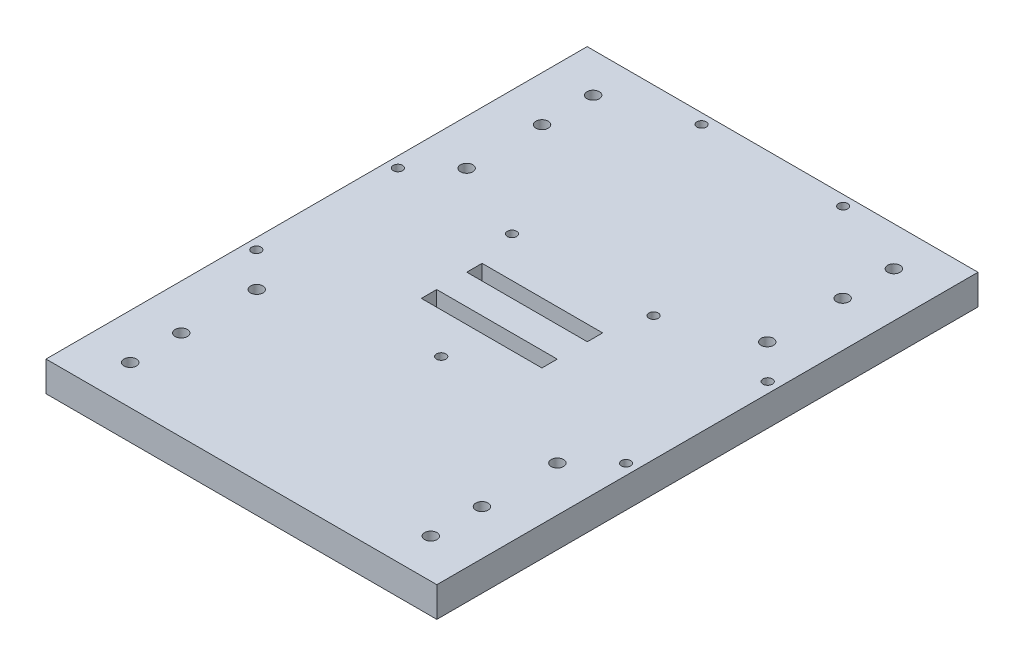
ISO-10303-21;
HEADER;
FILE_DESCRIPTION(('STEP AP214'),'2;1');
FILE_NAME('part.step','',(''),(''),'','','');
FILE_SCHEMA(('AUTOMOTIVE_DESIGN { 1 0 10303 214 1 1 1 1 }'));
ENDSEC;
DATA;
#1=APPLICATION_CONTEXT('core data for automotive mechanical design processes');
#2=APPLICATION_PROTOCOL_DEFINITION('international standard','automotive_design',2000,#1);
#3=PRODUCT_CONTEXT('',#1,'mechanical');
#4=PRODUCT('Part','Part','',(#3));
#5=PRODUCT_RELATED_PRODUCT_CATEGORY('part','',(#4));
#6=PRODUCT_DEFINITION_FORMATION('','',#4);
#7=PRODUCT_DEFINITION_CONTEXT('part definition',#1,'design');
#8=PRODUCT_DEFINITION('design','',#6,#7);
#9=PRODUCT_DEFINITION_SHAPE('','',#8);
#10=(LENGTH_UNIT() NAMED_UNIT(*) SI_UNIT(.MILLI.,.METRE.));
#11=(NAMED_UNIT(*) PLANE_ANGLE_UNIT() SI_UNIT($,.RADIAN.));
#12=(NAMED_UNIT(*) SI_UNIT($,.STERADIAN.) SOLID_ANGLE_UNIT());
#13=UNCERTAINTY_MEASURE_WITH_UNIT(LENGTH_MEASURE(1.E-05),#10,'distance_accuracy_value','');
#14=(GEOMETRIC_REPRESENTATION_CONTEXT(3) GLOBAL_UNCERTAINTY_ASSIGNED_CONTEXT((#13)) GLOBAL_UNIT_ASSIGNED_CONTEXT((#10,
#11,#12)) REPRESENTATION_CONTEXT('',''));
#15=CARTESIAN_POINT('',(0.,0.,0.));
#16=DIRECTION('',(0.,0.,1.));
#17=DIRECTION('',(1.,0.,0.));
#18=AXIS2_PLACEMENT_3D('',#15,#16,#17);
#19=CARTESIAN_POINT('',(0.,10.,0.));
#20=DIRECTION('',(0.,1.,0.));
#21=DIRECTION('',(0.,0.,1.));
#22=AXIS2_PLACEMENT_3D('',#19,#20,#21);
#23=PLANE('',#22);
#24=CARTESIAN_POINT('',(-23.5499999999998,10.,-23.5499999999994));
#25=DIRECTION('',(0.,1.,0.));
#26=DIRECTION('',(0.,0.,1.));
#27=AXIS2_PLACEMENT_3D('',#24,#25,#26);
#28=CIRCLE('',#27,1.55);
#29=CARTESIAN_POINT('',(-23.5499999999998,10.,-21.9999999999994));
#30=VERTEX_POINT('',#29);
#31=EDGE_CURVE('E821',#30,#30,#28,.T.);
#32=ORIENTED_EDGE('',*,*,#31,.F.);
#33=EDGE_LOOP('',(#32));
#34=FACE_BOUND('',#33,.T.);
#35=CARTESIAN_POINT('',(-61.5000000000001,10.,-23.5499999999991));
#36=DIRECTION('',(0.,1.,0.));
#37=DIRECTION('',(0.,0.,1.));
#38=AXIS2_PLACEMENT_3D('',#35,#36,#37);
#39=CIRCLE('',#38,1.54999999999999);
#40=CARTESIAN_POINT('',(-61.5000000000001,10.,-21.9999999999991));
#41=VERTEX_POINT('',#40);
#42=EDGE_CURVE('E825',#41,#41,#39,.T.);
#43=ORIENTED_EDGE('',*,*,#42,.F.);
#44=EDGE_LOOP('',(#43));
#45=FACE_BOUND('',#44,.T.);
#46=CARTESIAN_POINT('',(23.5500000000002,10.,-23.5499999999997));
#47=DIRECTION('',(0.,1.,0.));
#48=DIRECTION('',(0.,0.,1.));
#49=AXIS2_PLACEMENT_3D('',#46,#47,#48);
#50=CIRCLE('',#49,1.54999999999999);
#51=CARTESIAN_POINT('',(23.5500000000002,10.,-21.9999999999997));
#52=VERTEX_POINT('',#51);
#53=EDGE_CURVE('E832',#52,#52,#50,.T.);
#54=ORIENTED_EDGE('',*,*,#53,.F.);
#55=EDGE_LOOP('',(#54));
#56=FACE_BOUND('',#55,.T.);
#57=CARTESIAN_POINT('',(23.5499999999997,10.,-86.5999999999998));
#58=DIRECTION('',(0.,1.,0.));
#59=DIRECTION('',(0.,0.,1.));
#60=AXIS2_PLACEMENT_3D('',#57,#58,#59);
#61=CIRCLE('',#60,1.54999999999999);
#62=CARTESIAN_POINT('',(23.5499999999997,10.,-85.0499999999998));
#63=VERTEX_POINT('',#62);
#64=EDGE_CURVE('E838',#63,#63,#61,.T.);
#65=ORIENTED_EDGE('',*,*,#64,.F.);
#66=EDGE_LOOP('',(#65));
#67=FACE_BOUND('',#66,.T.);
#68=CARTESIAN_POINT('',(61.5000000000008,10.,23.55));
#69=DIRECTION('',(0.,1.,0.));
#70=DIRECTION('',(0.,0.,1.));
#71=AXIS2_PLACEMENT_3D('',#68,#69,#70);
#72=CIRCLE('',#71,1.55000000000001);
#73=CARTESIAN_POINT('',(61.5000000000008,10.,25.1));
#74=VERTEX_POINT('',#73);
#75=EDGE_CURVE('E853',#74,#74,#72,.T.);
#76=ORIENTED_EDGE('',*,*,#75,.F.);
#77=EDGE_LOOP('',(#76));
#78=FACE_BOUND('',#77,.T.);
#79=CARTESIAN_POINT('',(7.91033905045424E-13,10.,23.5500000000005));
#80=DIRECTION('',(0.,1.,0.));
#81=DIRECTION('',(0.,0.,1.));
#82=AXIS2_PLACEMENT_3D('',#79,#80,#81);
#83=CIRCLE('',#82,1.55);
#84=CARTESIAN_POINT('',(7.91033905045424E-13,10.,25.1000000000005));
#85=VERTEX_POINT('',#84);
#86=EDGE_CURVE('E857',#85,#85,#83,.T.);
#87=ORIENTED_EDGE('',*,*,#86,.F.);
#88=EDGE_LOOP('',(#87));
#89=FACE_BOUND('',#88,.T.);
#90=CARTESIAN_POINT('',(-61.4999999999998,10.,23.5500000000009));
#91=DIRECTION('',(0.,1.,0.));
#92=DIRECTION('',(0.,0.,1.));
#93=AXIS2_PLACEMENT_3D('',#90,#91,#92);
#94=CIRCLE('',#93,1.55);
#95=CARTESIAN_POINT('',(-61.4999999999998,10.,25.1000000000009));
#96=VERTEX_POINT('',#95);
#97=EDGE_CURVE('E861',#96,#96,#94,.T.);
#98=ORIENTED_EDGE('',*,*,#97,.F.);
#99=EDGE_LOOP('',(#98));
#100=FACE_BOUND('',#99,.T.);
#101=CARTESIAN_POINT('',(61.5000000000005,10.,-23.55));
#102=DIRECTION('',(0.,1.,0.));
#103=DIRECTION('',(0.,0.,1.));
#104=AXIS2_PLACEMENT_3D('',#101,#102,#103);
#105=CIRCLE('',#104,1.54999999999999);
#106=CARTESIAN_POINT('',(61.5000000000005,10.,-22.));
#107=VERTEX_POINT('',#106);
#108=EDGE_CURVE('E844',#107,#107,#105,.T.);
#109=ORIENTED_EDGE('',*,*,#108,.F.);
#110=EDGE_LOOP('',(#109));
#111=FACE_BOUND('',#110,.T.);
#112=CARTESIAN_POINT('',(-23.5500000000003,10.,-86.5999999999995));
#113=DIRECTION('',(0.,1.,0.));
#114=DIRECTION('',(0.,0.,1.));
#115=AXIS2_PLACEMENT_3D('',#112,#113,#114);
#116=CIRCLE('',#115,1.55);
#117=CARTESIAN_POINT('',(-23.5500000000003,10.,-85.0499999999995));
#118=VERTEX_POINT('',#117);
#119=EDGE_CURVE('E822',#118,#118,#116,.T.);
#120=ORIENTED_EDGE('',*,*,#119,.F.);
#121=EDGE_LOOP('',(#120));
#122=FACE_BOUND('',#121,.T.);
#123=DIRECTION('',(0.,0.,1.));
#124=VECTOR('',#123,1.);
#125=CARTESIAN_POINT('',(-20.05,10.,-10.1));
#126=LINE('',#125,#124);
#127=CARTESIAN_POINT('',(-20.05,10.,-10.1));
#128=VERTEX_POINT('',#127);
#129=CARTESIAN_POINT('',(-20.05,10.,-5.));
#130=VERTEX_POINT('',#129);
#131=EDGE_CURVE('E54',#128,#130,#126,.T.);
#132=ORIENTED_EDGE('',*,*,#131,.F.);
#133=DIRECTION('',(-1.,0.,0.));
#134=VECTOR('',#133,1.);
#135=CARTESIAN_POINT('',(20.05,10.,-10.1));
#136=LINE('',#135,#134);
#137=CARTESIAN_POINT('',(20.05,10.,-10.1));
#138=VERTEX_POINT('',#137);
#139=EDGE_CURVE('E149',#138,#128,#136,.T.);
#140=ORIENTED_EDGE('',*,*,#139,.F.);
#141=DIRECTION('',(0.,0.,-1.));
#142=VECTOR('',#141,1.);
#143=CARTESIAN_POINT('',(20.05,10.,-5.));
#144=LINE('',#143,#142);
#145=CARTESIAN_POINT('',(20.05,10.,-5.));
#146=VERTEX_POINT('',#145);
#147=EDGE_CURVE('E152',#146,#138,#144,.T.);
#148=ORIENTED_EDGE('',*,*,#147,.F.);
#149=DIRECTION('',(1.,0.,0.));
#150=VECTOR('',#149,1.);
#151=CARTESIAN_POINT('',(-20.05,10.,-5.));
#152=LINE('',#151,#150);
#153=EDGE_CURVE('E161',#130,#146,#152,.T.);
#154=ORIENTED_EDGE('',*,*,#153,.F.);
#155=EDGE_LOOP('',(#132,#140,#148,#154));
#156=FACE_BOUND('',#155,.T.);
#157=DIRECTION('',(0.,0.,-1.));
#158=VECTOR('',#157,1.);
#159=CARTESIAN_POINT('',(20.05,10.,10.1));
#160=LINE('',#159,#158);
#161=CARTESIAN_POINT('',(20.05,10.,10.1));
#162=VERTEX_POINT('',#161);
#163=CARTESIAN_POINT('',(20.05,10.,5.));
#164=VERTEX_POINT('',#163);
#165=EDGE_CURVE('E62',#162,#164,#160,.T.);
#166=ORIENTED_EDGE('',*,*,#165,.F.);
#167=DIRECTION('',(1.,0.,0.));
#168=VECTOR('',#167,1.);
#169=CARTESIAN_POINT('',(-20.05,10.,10.1));
#170=LINE('',#169,#168);
#171=CARTESIAN_POINT('',(-20.05,10.,10.1));
#172=VERTEX_POINT('',#171);
#173=EDGE_CURVE('E180',#172,#162,#170,.T.);
#174=ORIENTED_EDGE('',*,*,#173,.F.);
#175=DIRECTION('',(0.,0.,1.));
#176=VECTOR('',#175,1.);
#177=CARTESIAN_POINT('',(-20.05,10.,5.));
#178=LINE('',#177,#176);
#179=CARTESIAN_POINT('',(-20.05,10.,5.));
#180=VERTEX_POINT('',#179);
#181=EDGE_CURVE('E183',#180,#172,#178,.T.);
#182=ORIENTED_EDGE('',*,*,#181,.F.);
#183=DIRECTION('',(-1.,0.,0.));
#184=VECTOR('',#183,1.);
#185=CARTESIAN_POINT('',(-20.05,10.,5.));
#186=LINE('',#185,#184);
#187=EDGE_CURVE('E187',#164,#180,#186,.T.);
#188=ORIENTED_EDGE('',*,*,#187,.F.);
#189=EDGE_LOOP('',(#166,#174,#182,#188));
#190=FACE_BOUND('',#189,.T.);
#191=CARTESIAN_POINT('',(-50.,10.,-77.));
#192=DIRECTION('',(0.,1.,0.));
#193=DIRECTION('',(0.,0.,1.));
#194=AXIS2_PLACEMENT_3D('',#191,#192,#193);
#195=CIRCLE('',#194,2.04999999999999);
#196=CARTESIAN_POINT('',(-50.,10.,-74.95));
#197=VERTEX_POINT('',#196);
#198=EDGE_CURVE('E280',#197,#197,#195,.T.);
#199=ORIENTED_EDGE('',*,*,#198,.F.);
#200=EDGE_LOOP('',(#199));
#201=FACE_BOUND('',#200,.T.);
#202=DIRECTION('',(0.,0.,1.));
#203=VECTOR('',#202,1.);
#204=CARTESIAN_POINT('',(-65.,10.,-90.));
#205=LINE('',#204,#203);
#206=CARTESIAN_POINT('',(-65.,10.,-90.));
#207=VERTEX_POINT('',#206);
#208=CARTESIAN_POINT('',(-65.,10.,90.));
#209=VERTEX_POINT('',#208);
#210=EDGE_CURVE('E47',#207,#209,#205,.T.);
#211=ORIENTED_EDGE('',*,*,#210,.T.);
#212=DIRECTION('',(1.,0.,0.));
#213=VECTOR('',#212,1.);
#214=CARTESIAN_POINT('',(0.,10.,90.));
#215=LINE('',#214,#213);
#216=CARTESIAN_POINT('',(65.,10.,90.));
#217=VERTEX_POINT('',#216);
#218=EDGE_CURVE('E240',#209,#217,#215,.T.);
#219=ORIENTED_EDGE('',*,*,#218,.T.);
#220=DIRECTION('',(0.,0.,1.));
#221=VECTOR('',#220,1.);
#222=CARTESIAN_POINT('',(65.,10.,-90.));
#223=LINE('',#222,#221);
#224=CARTESIAN_POINT('',(65.,10.,-90.));
#225=VERTEX_POINT('',#224);
#226=EDGE_CURVE('E267',#225,#217,#223,.T.);
#227=ORIENTED_EDGE('',*,*,#226,.F.);
#228=DIRECTION('',(-1.,0.,0.));
#229=VECTOR('',#228,1.);
#230=CARTESIAN_POINT('',(0.,10.,-90.));
#231=LINE('',#230,#229);
#232=EDGE_CURVE('E292',#225,#207,#231,.T.);
#233=ORIENTED_EDGE('',*,*,#232,.T.);
#234=EDGE_LOOP('',(#211,#219,#227,#233));
#235=FACE_BOUND('',#234,.T.);
#236=CARTESIAN_POINT('',(-50.,10.,-60.));
#237=DIRECTION('',(0.,1.,0.));
#238=DIRECTION('',(0.,0.,1.));
#239=AXIS2_PLACEMENT_3D('',#236,#237,#238);
#240=CIRCLE('',#239,2.05);
#241=CARTESIAN_POINT('',(-50.,10.,-57.95));
#242=VERTEX_POINT('',#241);
#243=EDGE_CURVE('E286',#242,#242,#240,.T.);
#244=ORIENTED_EDGE('',*,*,#243,.F.);
#245=EDGE_LOOP('',(#244));
#246=FACE_BOUND('',#245,.T.);
#247=CARTESIAN_POINT('',(-50.,10.,-34.9));
#248=DIRECTION('',(0.,1.,0.));
#249=DIRECTION('',(0.,0.,1.));
#250=AXIS2_PLACEMENT_3D('',#247,#248,#249);
#251=CIRCLE('',#250,2.04999999999999);
#252=CARTESIAN_POINT('',(-50.,10.,-32.85));
#253=VERTEX_POINT('',#252);
#254=EDGE_CURVE('E274',#253,#253,#251,.T.);
#255=ORIENTED_EDGE('',*,*,#254,.F.);
#256=EDGE_LOOP('',(#255));
#257=FACE_BOUND('',#256,.T.);
#258=CARTESIAN_POINT('',(50.,10.,-34.9));
#259=DIRECTION('',(0.,-1.,0.));
#260=DIRECTION('',(0.,0.,1.));
#261=AXIS2_PLACEMENT_3D('',#258,#259,#260);
#262=CIRCLE('',#261,2.04999999999999);
#263=CARTESIAN_POINT('',(50.,10.,-32.85));
#264=VERTEX_POINT('',#263);
#265=EDGE_CURVE('E249',#264,#264,#262,.T.);
#266=ORIENTED_EDGE('',*,*,#265,.T.);
#267=EDGE_LOOP('',(#266));
#268=FACE_BOUND('',#267,.T.);
#269=CARTESIAN_POINT('',(50.,10.,-77.));
#270=DIRECTION('',(0.,-1.,0.));
#271=DIRECTION('',(0.,0.,1.));
#272=AXIS2_PLACEMENT_3D('',#269,#270,#271);
#273=CIRCLE('',#272,2.04999999999999);
#274=CARTESIAN_POINT('',(50.,10.,-74.95));
#275=VERTEX_POINT('',#274);
#276=EDGE_CURVE('E255',#275,#275,#273,.T.);
#277=ORIENTED_EDGE('',*,*,#276,.T.);
#278=EDGE_LOOP('',(#277));
#279=FACE_BOUND('',#278,.T.);
#280=CARTESIAN_POINT('',(50.,10.,-60.));
#281=DIRECTION('',(0.,-1.,0.));
#282=DIRECTION('',(0.,0.,1.));
#283=AXIS2_PLACEMENT_3D('',#280,#281,#282);
#284=CIRCLE('',#283,2.05);
#285=CARTESIAN_POINT('',(50.,10.,-57.95));
#286=VERTEX_POINT('',#285);
#287=EDGE_CURVE('E261',#286,#286,#284,.T.);
#288=ORIENTED_EDGE('',*,*,#287,.T.);
#289=EDGE_LOOP('',(#288));
#290=FACE_BOUND('',#289,.T.);
#291=CARTESIAN_POINT('',(50.,10.,77.));
#292=DIRECTION('',(0.,1.,0.));
#293=DIRECTION('',(0.,0.,-1.));
#294=AXIS2_PLACEMENT_3D('',#291,#292,#293);
#295=CIRCLE('',#294,2.04999999999999);
#296=CARTESIAN_POINT('',(50.,10.,74.95));
#297=VERTEX_POINT('',#296);
#298=EDGE_CURVE('E228',#297,#297,#295,.T.);
#299=ORIENTED_EDGE('',*,*,#298,.F.);
#300=EDGE_LOOP('',(#299));
#301=FACE_BOUND('',#300,.T.);
#302=CARTESIAN_POINT('',(50.,10.,60.));
#303=DIRECTION('',(0.,1.,0.));
#304=DIRECTION('',(0.,0.,-1.));
#305=AXIS2_PLACEMENT_3D('',#302,#303,#304);
#306=CIRCLE('',#305,2.05);
#307=CARTESIAN_POINT('',(50.,10.,57.95));
#308=VERTEX_POINT('',#307);
#309=EDGE_CURVE('E234',#308,#308,#306,.T.);
#310=ORIENTED_EDGE('',*,*,#309,.F.);
#311=EDGE_LOOP('',(#310));
#312=FACE_BOUND('',#311,.T.);
#313=CARTESIAN_POINT('',(50.,10.,34.9));
#314=DIRECTION('',(0.,1.,0.));
#315=DIRECTION('',(0.,0.,-1.));
#316=AXIS2_PLACEMENT_3D('',#313,#314,#315);
#317=CIRCLE('',#316,2.04999999999999);
#318=CARTESIAN_POINT('',(50.,10.,32.85));
#319=VERTEX_POINT('',#318);
#320=EDGE_CURVE('E222',#319,#319,#317,.T.);
#321=ORIENTED_EDGE('',*,*,#320,.F.);
#322=EDGE_LOOP('',(#321));
#323=FACE_BOUND('',#322,.T.);
#324=CARTESIAN_POINT('',(-50.,10.,34.9));
#325=DIRECTION('',(0.,-1.,0.));
#326=DIRECTION('',(0.,0.,-1.));
#327=AXIS2_PLACEMENT_3D('',#324,#325,#326);
#328=CIRCLE('',#327,2.04999999999999);
#329=CARTESIAN_POINT('',(-50.,10.,32.85));
#330=VERTEX_POINT('',#329);
#331=EDGE_CURVE('E201',#330,#330,#328,.T.);
#332=ORIENTED_EDGE('',*,*,#331,.T.);
#333=EDGE_LOOP('',(#332));
#334=FACE_BOUND('',#333,.T.);
#335=CARTESIAN_POINT('',(-50.,10.,77.));
#336=DIRECTION('',(0.,-1.,0.));
#337=DIRECTION('',(0.,0.,-1.));
#338=AXIS2_PLACEMENT_3D('',#335,#336,#337);
#339=CIRCLE('',#338,2.04999999999999);
#340=CARTESIAN_POINT('',(-50.,10.,74.95));
#341=VERTEX_POINT('',#340);
#342=EDGE_CURVE('E207',#341,#341,#339,.T.);
#343=ORIENTED_EDGE('',*,*,#342,.T.);
#344=EDGE_LOOP('',(#343));
#345=FACE_BOUND('',#344,.T.);
#346=CARTESIAN_POINT('',(-50.,10.,60.));
#347=DIRECTION('',(0.,-1.,0.));
#348=DIRECTION('',(0.,0.,-1.));
#349=AXIS2_PLACEMENT_3D('',#346,#347,#348);
#350=CIRCLE('',#349,2.05);
#351=CARTESIAN_POINT('',(-50.,10.,57.95));
#352=VERTEX_POINT('',#351);
#353=EDGE_CURVE('E213',#352,#352,#350,.T.);
#354=ORIENTED_EDGE('',*,*,#353,.T.);
#355=EDGE_LOOP('',(#354));
#356=FACE_BOUND('',#355,.T.);
#357=ADVANCED_FACE('F39',(#34,#45,#56,#67,#78,#89,#100,#111,#122,#156,#190,#201,#235,#246,#257,
#268,#279,#290,#301,#312,#323,#334,#345,#356),#23,.T.);
#358=CARTESIAN_POINT('',(0.,0.,0.));
#359=DIRECTION('',(0.,1.,0.));
#360=DIRECTION('',(0.,0.,1.));
#361=AXIS2_PLACEMENT_3D('',#358,#359,#360);
#362=PLANE('',#361);
#363=CARTESIAN_POINT('',(-23.5499999999998,0.,-23.5499999999994));
#364=DIRECTION('',(0.,1.,0.));
#365=DIRECTION('',(0.,0.,1.));
#366=AXIS2_PLACEMENT_3D('',#363,#364,#365);
#367=CIRCLE('',#366,1.55);
#368=CARTESIAN_POINT('',(-23.5499999999998,0.,-21.9999999999994));
#369=VERTEX_POINT('',#368);
#370=EDGE_CURVE('E819',#369,#369,#367,.F.);
#371=ORIENTED_EDGE('',*,*,#370,.F.);
#372=EDGE_LOOP('',(#371));
#373=FACE_BOUND('',#372,.T.);
#374=CARTESIAN_POINT('',(-61.5000000000001,0.,-23.5499999999991));
#375=DIRECTION('',(0.,1.,0.));
#376=DIRECTION('',(0.,0.,1.));
#377=AXIS2_PLACEMENT_3D('',#374,#375,#376);
#378=CIRCLE('',#377,1.54999999999999);
#379=CARTESIAN_POINT('',(-61.5000000000001,0.,-21.9999999999991));
#380=VERTEX_POINT('',#379);
#381=EDGE_CURVE('E829',#380,#380,#378,.F.);
#382=ORIENTED_EDGE('',*,*,#381,.F.);
#383=EDGE_LOOP('',(#382));
#384=FACE_BOUND('',#383,.T.);
#385=CARTESIAN_POINT('',(23.5500000000002,0.,-23.5499999999997));
#386=DIRECTION('',(0.,1.,0.));
#387=DIRECTION('',(0.,0.,1.));
#388=AXIS2_PLACEMENT_3D('',#385,#386,#387);
#389=CIRCLE('',#388,1.54999999999999);
#390=CARTESIAN_POINT('',(23.5500000000002,0.,-21.9999999999997));
#391=VERTEX_POINT('',#390);
#392=EDGE_CURVE('E835',#391,#391,#389,.F.);
#393=ORIENTED_EDGE('',*,*,#392,.F.);
#394=EDGE_LOOP('',(#393));
#395=FACE_BOUND('',#394,.T.);
#396=CARTESIAN_POINT('',(23.5499999999997,0.,-86.5999999999998));
#397=DIRECTION('',(0.,1.,0.));
#398=DIRECTION('',(0.,0.,1.));
#399=AXIS2_PLACEMENT_3D('',#396,#397,#398);
#400=CIRCLE('',#399,1.54999999999999);
#401=CARTESIAN_POINT('',(23.5499999999997,0.,-85.0499999999998));
#402=VERTEX_POINT('',#401);
#403=EDGE_CURVE('E841',#402,#402,#400,.F.);
#404=ORIENTED_EDGE('',*,*,#403,.F.);
#405=EDGE_LOOP('',(#404));
#406=FACE_BOUND('',#405,.T.);
#407=CARTESIAN_POINT('',(61.5000000000008,0.,23.55));
#408=DIRECTION('',(0.,1.,0.));
#409=DIRECTION('',(0.,0.,1.));
#410=AXIS2_PLACEMENT_3D('',#407,#408,#409);
#411=CIRCLE('',#410,1.55000000000001);
#412=CARTESIAN_POINT('',(61.5000000000008,0.,25.1));
#413=VERTEX_POINT('',#412);
#414=EDGE_CURVE('E884',#413,#413,#411,.F.);
#415=ORIENTED_EDGE('',*,*,#414,.F.);
#416=EDGE_LOOP('',(#415));
#417=FACE_BOUND('',#416,.T.);
#418=CARTESIAN_POINT('',(7.91033905045424E-13,0.,23.5500000000005));
#419=DIRECTION('',(0.,1.,0.));
#420=DIRECTION('',(0.,0.,1.));
#421=AXIS2_PLACEMENT_3D('',#418,#419,#420);
#422=CIRCLE('',#421,1.55);
#423=CARTESIAN_POINT('',(7.91033905045424E-13,0.,25.1000000000005));
#424=VERTEX_POINT('',#423);
#425=EDGE_CURVE('E878',#424,#424,#422,.F.);
#426=ORIENTED_EDGE('',*,*,#425,.F.);
#427=EDGE_LOOP('',(#426));
#428=FACE_BOUND('',#427,.T.);
#429=CARTESIAN_POINT('',(-61.4999999999998,0.,23.5500000000009));
#430=DIRECTION('',(0.,1.,0.));
#431=DIRECTION('',(0.,0.,1.));
#432=AXIS2_PLACEMENT_3D('',#429,#430,#431);
#433=CIRCLE('',#432,1.55);
#434=CARTESIAN_POINT('',(-61.4999999999998,0.,25.1000000000009));
#435=VERTEX_POINT('',#434);
#436=EDGE_CURVE('E874',#435,#435,#433,.F.);
#437=ORIENTED_EDGE('',*,*,#436,.F.);
#438=EDGE_LOOP('',(#437));
#439=FACE_BOUND('',#438,.T.);
#440=CARTESIAN_POINT('',(61.5000000000005,0.,-23.55));
#441=DIRECTION('',(0.,1.,0.));
#442=DIRECTION('',(0.,0.,1.));
#443=AXIS2_PLACEMENT_3D('',#440,#441,#442);
#444=CIRCLE('',#443,1.54999999999999);
#445=CARTESIAN_POINT('',(61.5000000000005,0.,-22.));
#446=VERTEX_POINT('',#445);
#447=EDGE_CURVE('E868',#446,#446,#444,.F.);
#448=ORIENTED_EDGE('',*,*,#447,.F.);
#449=EDGE_LOOP('',(#448));
#450=FACE_BOUND('',#449,.T.);
#451=CARTESIAN_POINT('',(-23.5500000000003,0.,-86.5999999999995));
#452=DIRECTION('',(0.,1.,0.));
#453=DIRECTION('',(0.,0.,1.));
#454=AXIS2_PLACEMENT_3D('',#451,#452,#453);
#455=CIRCLE('',#454,1.55);
#456=CARTESIAN_POINT('',(-23.5500000000003,0.,-85.0499999999995));
#457=VERTEX_POINT('',#456);
#458=EDGE_CURVE('E155',#457,#457,#455,.F.);
#459=ORIENTED_EDGE('',*,*,#458,.F.);
#460=EDGE_LOOP('',(#459));
#461=FACE_BOUND('',#460,.T.);
#462=DIRECTION('',(-1.,0.,0.));
#463=VECTOR('',#462,1.);
#464=CARTESIAN_POINT('',(20.05,0.,-10.1));
#465=LINE('',#464,#463);
#466=CARTESIAN_POINT('',(20.05,0.,-10.1));
#467=VERTEX_POINT('',#466);
#468=CARTESIAN_POINT('',(-20.05,0.,-10.1));
#469=VERTEX_POINT('',#468);
#470=EDGE_CURVE('E136',#467,#469,#465,.T.);
#471=ORIENTED_EDGE('',*,*,#470,.T.);
#472=DIRECTION('',(0.,0.,1.));
#473=VECTOR('',#472,1.);
#474=CARTESIAN_POINT('',(-20.05,0.,-10.1));
#475=LINE('',#474,#473);
#476=CARTESIAN_POINT('',(-20.05,0.,-5.));
#477=VERTEX_POINT('',#476);
#478=EDGE_CURVE('E130',#469,#477,#475,.T.);
#479=ORIENTED_EDGE('',*,*,#478,.T.);
#480=DIRECTION('',(1.,0.,0.));
#481=VECTOR('',#480,1.);
#482=CARTESIAN_POINT('',(-20.05,0.,-5.));
#483=LINE('',#482,#481);
#484=CARTESIAN_POINT('',(20.05,0.,-5.));
#485=VERTEX_POINT('',#484);
#486=EDGE_CURVE('E140',#477,#485,#483,.T.);
#487=ORIENTED_EDGE('',*,*,#486,.T.);
#488=DIRECTION('',(0.,0.,-1.));
#489=VECTOR('',#488,1.);
#490=CARTESIAN_POINT('',(20.05,0.,-5.));
#491=LINE('',#490,#489);
#492=EDGE_CURVE('E144',#485,#467,#491,.T.);
#493=ORIENTED_EDGE('',*,*,#492,.T.);
#494=EDGE_LOOP('',(#471,#479,#487,#493));
#495=FACE_BOUND('',#494,.T.);
#496=DIRECTION('',(1.,0.,0.));
#497=VECTOR('',#496,1.);
#498=CARTESIAN_POINT('',(-20.05,0.,10.1));
#499=LINE('',#498,#497);
#500=CARTESIAN_POINT('',(-20.05,0.,10.1));
#501=VERTEX_POINT('',#500);
#502=CARTESIAN_POINT('',(20.05,0.,10.1));
#503=VERTEX_POINT('',#502);
#504=EDGE_CURVE('E173',#501,#503,#499,.T.);
#505=ORIENTED_EDGE('',*,*,#504,.T.);
#506=DIRECTION('',(0.,0.,-1.));
#507=VECTOR('',#506,1.);
#508=CARTESIAN_POINT('',(20.05,0.,10.1));
#509=LINE('',#508,#507);
#510=CARTESIAN_POINT('',(20.05,0.,5.));
#511=VERTEX_POINT('',#510);
#512=EDGE_CURVE('E184',#503,#511,#509,.T.);
#513=ORIENTED_EDGE('',*,*,#512,.T.);
#514=DIRECTION('',(-1.,0.,0.));
#515=VECTOR('',#514,1.);
#516=CARTESIAN_POINT('',(-20.05,0.,5.));
#517=LINE('',#516,#515);
#518=CARTESIAN_POINT('',(-20.05,0.,5.));
#519=VERTEX_POINT('',#518);
#520=EDGE_CURVE('E196',#511,#519,#517,.T.);
#521=ORIENTED_EDGE('',*,*,#520,.T.);
#522=DIRECTION('',(0.,0.,1.));
#523=VECTOR('',#522,1.);
#524=CARTESIAN_POINT('',(-20.05,0.,5.));
#525=LINE('',#524,#523);
#526=EDGE_CURVE('E193',#519,#501,#525,.T.);
#527=ORIENTED_EDGE('',*,*,#526,.T.);
#528=EDGE_LOOP('',(#505,#513,#521,#527));
#529=FACE_BOUND('',#528,.T.);
#530=DIRECTION('',(1.,0.,0.));
#531=VECTOR('',#530,1.);
#532=CARTESIAN_POINT('',(0.,0.,90.));
#533=LINE('',#532,#531);
#534=CARTESIAN_POINT('',(-65.,0.,90.));
#535=VERTEX_POINT('',#534);
#536=CARTESIAN_POINT('',(65.,0.,90.));
#537=VERTEX_POINT('',#536);
#538=EDGE_CURVE('E237',#535,#537,#533,.T.);
#539=ORIENTED_EDGE('',*,*,#538,.F.);
#540=DIRECTION('',(0.,0.,1.));
#541=VECTOR('',#540,1.);
#542=CARTESIAN_POINT('',(-65.,0.,-90.));
#543=LINE('',#542,#541);
#544=CARTESIAN_POINT('',(-65.,0.,-90.));
#545=VERTEX_POINT('',#544);
#546=EDGE_CURVE('E294',#545,#535,#543,.T.);
#547=ORIENTED_EDGE('',*,*,#546,.F.);
#548=DIRECTION('',(-1.,0.,0.));
#549=VECTOR('',#548,1.);
#550=CARTESIAN_POINT('',(0.,0.,-90.));
#551=LINE('',#550,#549);
#552=CARTESIAN_POINT('',(65.,0.,-90.));
#553=VERTEX_POINT('',#552);
#554=EDGE_CURVE('E289',#553,#545,#551,.T.);
#555=ORIENTED_EDGE('',*,*,#554,.F.);
#556=DIRECTION('',(0.,0.,1.));
#557=VECTOR('',#556,1.);
#558=CARTESIAN_POINT('',(65.,0.,-90.));
#559=LINE('',#558,#557);
#560=EDGE_CURVE('E264',#553,#537,#559,.T.);
#561=ORIENTED_EDGE('',*,*,#560,.T.);
#562=EDGE_LOOP('',(#539,#547,#555,#561));
#563=FACE_BOUND('',#562,.T.);
#564=CARTESIAN_POINT('',(-50.,0.,-60.));
#565=DIRECTION('',(0.,1.,0.));
#566=DIRECTION('',(0.,0.,1.));
#567=AXIS2_PLACEMENT_3D('',#564,#565,#566);
#568=CIRCLE('',#567,2.05);
#569=CARTESIAN_POINT('',(-50.,0.,-57.95));
#570=VERTEX_POINT('',#569);
#571=EDGE_CURVE('E283',#570,#570,#568,.T.);
#572=ORIENTED_EDGE('',*,*,#571,.T.);
#573=EDGE_LOOP('',(#572));
#574=FACE_BOUND('',#573,.T.);
#575=CARTESIAN_POINT('',(-50.,0.,-77.));
#576=DIRECTION('',(0.,1.,0.));
#577=DIRECTION('',(0.,0.,1.));
#578=AXIS2_PLACEMENT_3D('',#575,#576,#577);
#579=CIRCLE('',#578,2.04999999999999);
#580=CARTESIAN_POINT('',(-50.,0.,-74.95));
#581=VERTEX_POINT('',#580);
#582=EDGE_CURVE('E277',#581,#581,#579,.T.);
#583=ORIENTED_EDGE('',*,*,#582,.T.);
#584=EDGE_LOOP('',(#583));
#585=FACE_BOUND('',#584,.T.);
#586=CARTESIAN_POINT('',(-50.,0.,-34.9));
#587=DIRECTION('',(0.,1.,0.));
#588=DIRECTION('',(0.,0.,1.));
#589=AXIS2_PLACEMENT_3D('',#586,#587,#588);
#590=CIRCLE('',#589,2.04999999999999);
#591=CARTESIAN_POINT('',(-50.,0.,-32.85));
#592=VERTEX_POINT('',#591);
#593=EDGE_CURVE('E273',#592,#592,#590,.T.);
#594=ORIENTED_EDGE('',*,*,#593,.T.);
#595=EDGE_LOOP('',(#594));
#596=FACE_BOUND('',#595,.T.);
#597=CARTESIAN_POINT('',(50.,0.,-34.9));
#598=DIRECTION('',(0.,-1.,0.));
#599=DIRECTION('',(0.,0.,1.));
#600=AXIS2_PLACEMENT_3D('',#597,#598,#599);
#601=CIRCLE('',#600,2.04999999999999);
#602=CARTESIAN_POINT('',(50.,0.,-32.85));
#603=VERTEX_POINT('',#602);
#604=EDGE_CURVE('E248',#603,#603,#601,.T.);
#605=ORIENTED_EDGE('',*,*,#604,.F.);
#606=EDGE_LOOP('',(#605));
#607=FACE_BOUND('',#606,.T.);
#608=CARTESIAN_POINT('',(50.,0.,-77.));
#609=DIRECTION('',(0.,-1.,0.));
#610=DIRECTION('',(0.,0.,1.));
#611=AXIS2_PLACEMENT_3D('',#608,#609,#610);
#612=CIRCLE('',#611,2.04999999999999);
#613=CARTESIAN_POINT('',(50.,0.,-74.95));
#614=VERTEX_POINT('',#613);
#615=EDGE_CURVE('E252',#614,#614,#612,.T.);
#616=ORIENTED_EDGE('',*,*,#615,.F.);
#617=EDGE_LOOP('',(#616));
#618=FACE_BOUND('',#617,.T.);
#619=CARTESIAN_POINT('',(50.,0.,-60.));
#620=DIRECTION('',(0.,-1.,0.));
#621=DIRECTION('',(0.,0.,1.));
#622=AXIS2_PLACEMENT_3D('',#619,#620,#621);
#623=CIRCLE('',#622,2.05);
#624=CARTESIAN_POINT('',(50.,0.,-57.95));
#625=VERTEX_POINT('',#624);
#626=EDGE_CURVE('E258',#625,#625,#623,.T.);
#627=ORIENTED_EDGE('',*,*,#626,.F.);
#628=EDGE_LOOP('',(#627));
#629=FACE_BOUND('',#628,.T.);
#630=CARTESIAN_POINT('',(50.,0.,60.));
#631=DIRECTION('',(0.,1.,0.));
#632=DIRECTION('',(0.,0.,-1.));
#633=AXIS2_PLACEMENT_3D('',#630,#631,#632);
#634=CIRCLE('',#633,2.05);
#635=CARTESIAN_POINT('',(50.,0.,57.95));
#636=VERTEX_POINT('',#635);
#637=EDGE_CURVE('E231',#636,#636,#634,.T.);
#638=ORIENTED_EDGE('',*,*,#637,.T.);
#639=EDGE_LOOP('',(#638));
#640=FACE_BOUND('',#639,.T.);
#641=CARTESIAN_POINT('',(50.,0.,77.));
#642=DIRECTION('',(0.,1.,0.));
#643=DIRECTION('',(0.,0.,-1.));
#644=AXIS2_PLACEMENT_3D('',#641,#642,#643);
#645=CIRCLE('',#644,2.04999999999999);
#646=CARTESIAN_POINT('',(50.,0.,74.95));
#647=VERTEX_POINT('',#646);
#648=EDGE_CURVE('E225',#647,#647,#645,.T.);
#649=ORIENTED_EDGE('',*,*,#648,.T.);
#650=EDGE_LOOP('',(#649));
#651=FACE_BOUND('',#650,.T.);
#652=CARTESIAN_POINT('',(50.,0.,34.9));
#653=DIRECTION('',(0.,1.,0.));
#654=DIRECTION('',(0.,0.,-1.));
#655=AXIS2_PLACEMENT_3D('',#652,#653,#654);
#656=CIRCLE('',#655,2.04999999999999);
#657=CARTESIAN_POINT('',(50.,0.,32.85));
#658=VERTEX_POINT('',#657);
#659=EDGE_CURVE('E221',#658,#658,#656,.T.);
#660=ORIENTED_EDGE('',*,*,#659,.T.);
#661=EDGE_LOOP('',(#660));
#662=FACE_BOUND('',#661,.T.);
#663=CARTESIAN_POINT('',(-50.,0.,34.9));
#664=DIRECTION('',(0.,-1.,0.));
#665=DIRECTION('',(0.,0.,-1.));
#666=AXIS2_PLACEMENT_3D('',#663,#664,#665);
#667=CIRCLE('',#666,2.04999999999999);
#668=CARTESIAN_POINT('',(-50.,0.,32.85));
#669=VERTEX_POINT('',#668);
#670=EDGE_CURVE('E167',#669,#669,#667,.T.);
#671=ORIENTED_EDGE('',*,*,#670,.F.);
#672=EDGE_LOOP('',(#671));
#673=FACE_BOUND('',#672,.T.);
#674=CARTESIAN_POINT('',(-50.,0.,77.));
#675=DIRECTION('',(0.,-1.,0.));
#676=DIRECTION('',(0.,0.,-1.));
#677=AXIS2_PLACEMENT_3D('',#674,#675,#676);
#678=CIRCLE('',#677,2.04999999999999);
#679=CARTESIAN_POINT('',(-50.,0.,74.95));
#680=VERTEX_POINT('',#679);
#681=EDGE_CURVE('E204',#680,#680,#678,.T.);
#682=ORIENTED_EDGE('',*,*,#681,.F.);
#683=EDGE_LOOP('',(#682));
#684=FACE_BOUND('',#683,.T.);
#685=CARTESIAN_POINT('',(-50.,0.,60.));
#686=DIRECTION('',(0.,-1.,0.));
#687=DIRECTION('',(0.,0.,-1.));
#688=AXIS2_PLACEMENT_3D('',#685,#686,#687);
#689=CIRCLE('',#688,2.05);
#690=CARTESIAN_POINT('',(-50.,0.,57.95));
#691=VERTEX_POINT('',#690);
#692=EDGE_CURVE('E210',#691,#691,#689,.T.);
#693=ORIENTED_EDGE('',*,*,#692,.F.);
#694=EDGE_LOOP('',(#693));
#695=FACE_BOUND('',#694,.T.);
#696=ADVANCED_FACE('F146',(#373,#384,#395,#406,#417,#428,#439,#450,#461,#495,#529,#563,#574,
#585,#596,#607,#618,#629,#640,#651,#662,#673,#684,#695),#362,.F.);
#697=CARTESIAN_POINT('',(0.,10.,-90.));
#698=DIRECTION('',(0.,0.,1.));
#699=DIRECTION('',(1.,0.,0.));
#700=AXIS2_PLACEMENT_3D('',#697,#698,#699);
#701=PLANE('',#700);
#702=ORIENTED_EDGE('',*,*,#554,.T.);
#703=DIRECTION('',(0.,-1.,0.));
#704=VECTOR('',#703,1.);
#705=CARTESIAN_POINT('',(-65.,10.,-90.));
#706=LINE('',#705,#704);
#707=EDGE_CURVE('E11',#207,#545,#706,.T.);
#708=ORIENTED_EDGE('',*,*,#707,.F.);
#709=ORIENTED_EDGE('',*,*,#232,.F.);
#710=DIRECTION('',(0.,-1.,0.));
#711=VECTOR('',#710,1.);
#712=CARTESIAN_POINT('',(65.,10.,-90.));
#713=LINE('',#712,#711);
#714=EDGE_CURVE('E269',#225,#553,#713,.T.);
#715=ORIENTED_EDGE('',*,*,#714,.T.);
#716=EDGE_LOOP('',(#702,#708,#709,#715));
#717=FACE_BOUND('',#716,.T.);
#718=ADVANCED_FACE('F41',(#717),#701,.F.);
#719=CARTESIAN_POINT('',(-65.,10.,-90.));
#720=DIRECTION('',(1.,0.,0.));
#721=DIRECTION('',(0.,0.,-1.));
#722=AXIS2_PLACEMENT_3D('',#719,#720,#721);
#723=PLANE('',#722);
#724=ORIENTED_EDGE('',*,*,#546,.T.);
#725=DIRECTION('',(0.,-1.,0.));
#726=VECTOR('',#725,1.);
#727=CARTESIAN_POINT('',(-65.,10.,90.));
#728=LINE('',#727,#726);
#729=EDGE_CURVE('E216',#209,#535,#728,.T.);
#730=ORIENTED_EDGE('',*,*,#729,.F.);
#731=ORIENTED_EDGE('',*,*,#210,.F.);
#732=ORIENTED_EDGE('',*,*,#707,.T.);
#733=EDGE_LOOP('',(#724,#730,#731,#732));
#734=FACE_BOUND('',#733,.T.);
#735=ADVANCED_FACE('F300',(#734),#723,.F.);
#736=CARTESIAN_POINT('',(-50.,10.,-60.));
#737=DIRECTION('',(0.,-1.,0.));
#738=DIRECTION('',(0.,0.,-1.));
#739=AXIS2_PLACEMENT_3D('',#736,#737,#738);
#740=CYLINDRICAL_SURFACE('',#739,2.05);
#741=ORIENTED_EDGE('',*,*,#243,.T.);
#742=EDGE_LOOP('',(#741));
#743=FACE_BOUND('',#742,.T.);
#744=ORIENTED_EDGE('',*,*,#571,.F.);
#745=EDGE_LOOP('',(#744));
#746=FACE_BOUND('',#745,.T.);
#747=ADVANCED_FACE('F342',(#743,#746),#740,.F.);
#748=CARTESIAN_POINT('',(-50.,10.,-77.));
#749=DIRECTION('',(0.,-1.,0.));
#750=DIRECTION('',(0.,0.,-1.));
#751=AXIS2_PLACEMENT_3D('',#748,#749,#750);
#752=CYLINDRICAL_SURFACE('',#751,2.04999999999999);
#753=ORIENTED_EDGE('',*,*,#198,.T.);
#754=EDGE_LOOP('',(#753));
#755=FACE_BOUND('',#754,.T.);
#756=ORIENTED_EDGE('',*,*,#582,.F.);
#757=EDGE_LOOP('',(#756));
#758=FACE_BOUND('',#757,.T.);
#759=ADVANCED_FACE('F328',(#755,#758),#752,.F.);
#760=CARTESIAN_POINT('',(-50.,10.,-34.9));
#761=DIRECTION('',(0.,-1.,0.));
#762=DIRECTION('',(0.,0.,-1.));
#763=AXIS2_PLACEMENT_3D('',#760,#761,#762);
#764=CYLINDRICAL_SURFACE('',#763,2.04999999999999);
#765=ORIENTED_EDGE('',*,*,#254,.T.);
#766=EDGE_LOOP('',(#765));
#767=FACE_BOUND('',#766,.T.);
#768=ORIENTED_EDGE('',*,*,#593,.F.);
#769=EDGE_LOOP('',(#768));
#770=FACE_BOUND('',#769,.T.);
#771=ADVANCED_FACE('F319',(#767,#770),#764,.F.);
#772=CARTESIAN_POINT('',(65.,10.,-90.));
#773=DIRECTION('',(1.,0.,0.));
#774=DIRECTION('',(0.,0.,-1.));
#775=AXIS2_PLACEMENT_3D('',#772,#773,#774);
#776=PLANE('',#775);
#777=ORIENTED_EDGE('',*,*,#560,.F.);
#778=ORIENTED_EDGE('',*,*,#714,.F.);
#779=ORIENTED_EDGE('',*,*,#226,.T.);
#780=DIRECTION('',(0.,-1.,0.));
#781=VECTOR('',#780,1.);
#782=CARTESIAN_POINT('',(65.,10.,90.));
#783=LINE('',#782,#781);
#784=EDGE_CURVE('E243',#217,#537,#783,.T.);
#785=ORIENTED_EDGE('',*,*,#784,.T.);
#786=EDGE_LOOP('',(#777,#778,#779,#785));
#787=FACE_BOUND('',#786,.T.);
#788=ADVANCED_FACE('F316',(#787),#776,.T.);
#789=CARTESIAN_POINT('',(50.,10.,-60.));
#790=DIRECTION('',(0.,-1.,0.));
#791=DIRECTION('',(0.,0.,-1.));
#792=AXIS2_PLACEMENT_3D('',#789,#790,#791);
#793=CYLINDRICAL_SURFACE('',#792,2.05);
#794=ORIENTED_EDGE('',*,*,#287,.F.);
#795=EDGE_LOOP('',(#794));
#796=FACE_BOUND('',#795,.T.);
#797=ORIENTED_EDGE('',*,*,#626,.T.);
#798=EDGE_LOOP('',(#797));
#799=FACE_BOUND('',#798,.T.);
#800=ADVANCED_FACE('F318',(#796,#799),#793,.F.);
#801=CARTESIAN_POINT('',(50.,10.,-77.));
#802=DIRECTION('',(0.,-1.,0.));
#803=DIRECTION('',(0.,0.,-1.));
#804=AXIS2_PLACEMENT_3D('',#801,#802,#803);
#805=CYLINDRICAL_SURFACE('',#804,2.04999999999999);
#806=ORIENTED_EDGE('',*,*,#276,.F.);
#807=EDGE_LOOP('',(#806));
#808=FACE_BOUND('',#807,.T.);
#809=ORIENTED_EDGE('',*,*,#615,.T.);
#810=EDGE_LOOP('',(#809));
#811=FACE_BOUND('',#810,.T.);
#812=ADVANCED_FACE('F325',(#808,#811),#805,.F.);
#813=CARTESIAN_POINT('',(50.,10.,-34.9));
#814=DIRECTION('',(0.,-1.,0.));
#815=DIRECTION('',(0.,0.,-1.));
#816=AXIS2_PLACEMENT_3D('',#813,#814,#815);
#817=CYLINDRICAL_SURFACE('',#816,2.04999999999999);
#818=ORIENTED_EDGE('',*,*,#265,.F.);
#819=EDGE_LOOP('',(#818));
#820=FACE_BOUND('',#819,.T.);
#821=ORIENTED_EDGE('',*,*,#604,.T.);
#822=EDGE_LOOP('',(#821));
#823=FACE_BOUND('',#822,.T.);
#824=ADVANCED_FACE('F615',(#820,#823),#817,.F.);
#825=CARTESIAN_POINT('',(0.,10.,90.));
#826=DIRECTION('',(0.,0.,-1.));
#827=DIRECTION('',(-1.,0.,0.));
#828=AXIS2_PLACEMENT_3D('',#825,#826,#827);
#829=PLANE('',#828);
#830=ORIENTED_EDGE('',*,*,#538,.T.);
#831=ORIENTED_EDGE('',*,*,#784,.F.);
#832=ORIENTED_EDGE('',*,*,#218,.F.);
#833=ORIENTED_EDGE('',*,*,#729,.T.);
#834=EDGE_LOOP('',(#830,#831,#832,#833));
#835=FACE_BOUND('',#834,.T.);
#836=ADVANCED_FACE('F309',(#835),#829,.F.);
#837=CARTESIAN_POINT('',(50.,10.,60.));
#838=DIRECTION('',(0.,-1.,0.));
#839=DIRECTION('',(0.,0.,-1.));
#840=AXIS2_PLACEMENT_3D('',#837,#838,#839);
#841=CYLINDRICAL_SURFACE('',#840,2.05);
#842=ORIENTED_EDGE('',*,*,#309,.T.);
#843=EDGE_LOOP('',(#842));
#844=FACE_BOUND('',#843,.T.);
#845=ORIENTED_EDGE('',*,*,#637,.F.);
#846=EDGE_LOOP('',(#845));
#847=FACE_BOUND('',#846,.T.);
#848=ADVANCED_FACE('F595',(#844,#847),#841,.F.);
#849=CARTESIAN_POINT('',(50.,10.,77.));
#850=DIRECTION('',(0.,-1.,0.));
#851=DIRECTION('',(0.,0.,-1.));
#852=AXIS2_PLACEMENT_3D('',#849,#850,#851);
#853=CYLINDRICAL_SURFACE('',#852,2.04999999999999);
#854=ORIENTED_EDGE('',*,*,#298,.T.);
#855=EDGE_LOOP('',(#854));
#856=FACE_BOUND('',#855,.T.);
#857=ORIENTED_EDGE('',*,*,#648,.F.);
#858=EDGE_LOOP('',(#857));
#859=FACE_BOUND('',#858,.T.);
#860=ADVANCED_FACE('F585',(#856,#859),#853,.F.);
#861=CARTESIAN_POINT('',(50.,10.,34.9));
#862=DIRECTION('',(0.,-1.,0.));
#863=DIRECTION('',(0.,0.,-1.));
#864=AXIS2_PLACEMENT_3D('',#861,#862,#863);
#865=CYLINDRICAL_SURFACE('',#864,2.04999999999999);
#866=ORIENTED_EDGE('',*,*,#320,.T.);
#867=EDGE_LOOP('',(#866));
#868=FACE_BOUND('',#867,.T.);
#869=ORIENTED_EDGE('',*,*,#659,.F.);
#870=EDGE_LOOP('',(#869));
#871=FACE_BOUND('',#870,.T.);
#872=ADVANCED_FACE('F575',(#868,#871),#865,.F.);
#873=CARTESIAN_POINT('',(-50.,10.,60.));
#874=DIRECTION('',(0.,-1.,0.));
#875=DIRECTION('',(0.,0.,-1.));
#876=AXIS2_PLACEMENT_3D('',#873,#874,#875);
#877=CYLINDRICAL_SURFACE('',#876,2.05);
#878=ORIENTED_EDGE('',*,*,#353,.F.);
#879=EDGE_LOOP('',(#878));
#880=FACE_BOUND('',#879,.T.);
#881=ORIENTED_EDGE('',*,*,#692,.T.);
#882=EDGE_LOOP('',(#881));
#883=FACE_BOUND('',#882,.T.);
#884=ADVANCED_FACE('F565',(#880,#883),#877,.F.);
#885=CARTESIAN_POINT('',(-50.,10.,77.));
#886=DIRECTION('',(0.,-1.,0.));
#887=DIRECTION('',(0.,0.,-1.));
#888=AXIS2_PLACEMENT_3D('',#885,#886,#887);
#889=CYLINDRICAL_SURFACE('',#888,2.04999999999999);
#890=ORIENTED_EDGE('',*,*,#342,.F.);
#891=EDGE_LOOP('',(#890));
#892=FACE_BOUND('',#891,.T.);
#893=ORIENTED_EDGE('',*,*,#681,.T.);
#894=EDGE_LOOP('',(#893));
#895=FACE_BOUND('',#894,.T.);
#896=ADVANCED_FACE('F555',(#892,#895),#889,.F.);
#897=CARTESIAN_POINT('',(-50.,10.,34.9));
#898=DIRECTION('',(0.,-1.,0.));
#899=DIRECTION('',(0.,0.,-1.));
#900=AXIS2_PLACEMENT_3D('',#897,#898,#899);
#901=CYLINDRICAL_SURFACE('',#900,2.04999999999999);
#902=ORIENTED_EDGE('',*,*,#331,.F.);
#903=EDGE_LOOP('',(#902));
#904=FACE_BOUND('',#903,.T.);
#905=ORIENTED_EDGE('',*,*,#670,.T.);
#906=EDGE_LOOP('',(#905));
#907=FACE_BOUND('',#906,.T.);
#908=ADVANCED_FACE('F546',(#904,#907),#901,.F.);
#909=CARTESIAN_POINT('',(20.05,0.,10.1));
#910=DIRECTION('',(1.,0.,0.));
#911=DIRECTION('',(0.,0.,-1.));
#912=AXIS2_PLACEMENT_3D('',#909,#910,#911);
#913=PLANE('',#912);
#914=ORIENTED_EDGE('',*,*,#165,.T.);
#915=DIRECTION('',(0.,1.,0.));
#916=VECTOR('',#915,1.);
#917=CARTESIAN_POINT('',(20.05,0.,5.));
#918=LINE('',#917,#916);
#919=EDGE_CURVE('E171',#511,#164,#918,.T.);
#920=ORIENTED_EDGE('',*,*,#919,.F.);
#921=ORIENTED_EDGE('',*,*,#512,.F.);
#922=DIRECTION('',(0.,1.,0.));
#923=VECTOR('',#922,1.);
#924=CARTESIAN_POINT('',(20.05,0.,10.1));
#925=LINE('',#924,#923);
#926=EDGE_CURVE('E178',#503,#162,#925,.T.);
#927=ORIENTED_EDGE('',*,*,#926,.T.);
#928=EDGE_LOOP('',(#914,#920,#921,#927));
#929=FACE_BOUND('',#928,.T.);
#930=ADVANCED_FACE('F536',(#929),#913,.F.);
#931=CARTESIAN_POINT('',(-20.05,0.,10.1));
#932=DIRECTION('',(0.,0.,1.));
#933=DIRECTION('',(1.,0.,0.));
#934=AXIS2_PLACEMENT_3D('',#931,#932,#933);
#935=PLANE('',#934);
#936=ORIENTED_EDGE('',*,*,#173,.T.);
#937=ORIENTED_EDGE('',*,*,#926,.F.);
#938=ORIENTED_EDGE('',*,*,#504,.F.);
#939=DIRECTION('',(0.,1.,0.));
#940=VECTOR('',#939,1.);
#941=CARTESIAN_POINT('',(-20.05,0.,10.1));
#942=LINE('',#941,#940);
#943=EDGE_CURVE('E176',#501,#172,#942,.T.);
#944=ORIENTED_EDGE('',*,*,#943,.T.);
#945=EDGE_LOOP('',(#936,#937,#938,#944));
#946=FACE_BOUND('',#945,.T.);
#947=ADVANCED_FACE('F526',(#946),#935,.F.);
#948=CARTESIAN_POINT('',(-20.05,0.,5.));
#949=DIRECTION('',(-1.,0.,0.));
#950=DIRECTION('',(0.,0.,1.));
#951=AXIS2_PLACEMENT_3D('',#948,#949,#950);
#952=PLANE('',#951);
#953=ORIENTED_EDGE('',*,*,#181,.T.);
#954=ORIENTED_EDGE('',*,*,#943,.F.);
#955=ORIENTED_EDGE('',*,*,#526,.F.);
#956=DIRECTION('',(0.,1.,0.));
#957=VECTOR('',#956,1.);
#958=CARTESIAN_POINT('',(-20.05,0.,5.));
#959=LINE('',#958,#957);
#960=EDGE_CURVE('E174',#519,#180,#959,.T.);
#961=ORIENTED_EDGE('',*,*,#960,.T.);
#962=EDGE_LOOP('',(#953,#954,#955,#961));
#963=FACE_BOUND('',#962,.T.);
#964=ADVANCED_FACE('F516',(#963),#952,.F.);
#965=CARTESIAN_POINT('',(-20.05,0.,5.));
#966=DIRECTION('',(0.,0.,-1.));
#967=DIRECTION('',(-1.,0.,0.));
#968=AXIS2_PLACEMENT_3D('',#965,#966,#967);
#969=PLANE('',#968);
#970=ORIENTED_EDGE('',*,*,#187,.T.);
#971=ORIENTED_EDGE('',*,*,#960,.F.);
#972=ORIENTED_EDGE('',*,*,#520,.F.);
#973=ORIENTED_EDGE('',*,*,#919,.T.);
#974=EDGE_LOOP('',(#970,#971,#972,#973));
#975=FACE_BOUND('',#974,.T.);
#976=ADVANCED_FACE('F507',(#975),#969,.F.);
#977=CARTESIAN_POINT('',(-20.05,0.,-10.1));
#978=DIRECTION('',(-1.,0.,0.));
#979=DIRECTION('',(0.,0.,1.));
#980=AXIS2_PLACEMENT_3D('',#977,#978,#979);
#981=PLANE('',#980);
#982=ORIENTED_EDGE('',*,*,#131,.T.);
#983=DIRECTION('',(0.,1.,0.));
#984=VECTOR('',#983,1.);
#985=CARTESIAN_POINT('',(-20.05,0.,-5.));
#986=LINE('',#985,#984);
#987=EDGE_CURVE('E126',#477,#130,#986,.T.);
#988=ORIENTED_EDGE('',*,*,#987,.F.);
#989=ORIENTED_EDGE('',*,*,#478,.F.);
#990=DIRECTION('',(0.,1.,0.));
#991=VECTOR('',#990,1.);
#992=CARTESIAN_POINT('',(-20.05,0.,-10.1));
#993=LINE('',#992,#991);
#994=EDGE_CURVE('E165',#469,#128,#993,.T.);
#995=ORIENTED_EDGE('',*,*,#994,.T.);
#996=EDGE_LOOP('',(#982,#988,#989,#995));
#997=FACE_BOUND('',#996,.T.);
#998=ADVANCED_FACE('F128',(#997),#981,.F.);
#999=CARTESIAN_POINT('',(20.05,0.,-10.1));
#1000=DIRECTION('',(0.,0.,-1.));
#1001=DIRECTION('',(-1.,0.,0.));
#1002=AXIS2_PLACEMENT_3D('',#999,#1000,#1001);
#1003=PLANE('',#1002);
#1004=ORIENTED_EDGE('',*,*,#139,.T.);
#1005=ORIENTED_EDGE('',*,*,#994,.F.);
#1006=ORIENTED_EDGE('',*,*,#470,.F.);
#1007=DIRECTION('',(0.,1.,0.));
#1008=VECTOR('',#1007,1.);
#1009=CARTESIAN_POINT('',(20.05,0.,-10.1));
#1010=LINE('',#1009,#1008);
#1011=EDGE_CURVE('E168',#467,#138,#1010,.T.);
#1012=ORIENTED_EDGE('',*,*,#1011,.T.);
#1013=EDGE_LOOP('',(#1004,#1005,#1006,#1012));
#1014=FACE_BOUND('',#1013,.T.);
#1015=ADVANCED_FACE('F488',(#1014),#1003,.F.);
#1016=CARTESIAN_POINT('',(20.05,0.,-5.));
#1017=DIRECTION('',(1.,0.,0.));
#1018=DIRECTION('',(0.,0.,-1.));
#1019=AXIS2_PLACEMENT_3D('',#1016,#1017,#1018);
#1020=PLANE('',#1019);
#1021=ORIENTED_EDGE('',*,*,#147,.T.);
#1022=ORIENTED_EDGE('',*,*,#1011,.F.);
#1023=ORIENTED_EDGE('',*,*,#492,.F.);
#1024=DIRECTION('',(0.,1.,0.));
#1025=VECTOR('',#1024,1.);
#1026=CARTESIAN_POINT('',(20.05,0.,-5.));
#1027=LINE('',#1026,#1025);
#1028=EDGE_CURVE('E135',#485,#146,#1027,.T.);
#1029=ORIENTED_EDGE('',*,*,#1028,.T.);
#1030=EDGE_LOOP('',(#1021,#1022,#1023,#1029));
#1031=FACE_BOUND('',#1030,.T.);
#1032=ADVANCED_FACE('F480',(#1031),#1020,.F.);
#1033=CARTESIAN_POINT('',(-20.05,0.,-5.));
#1034=DIRECTION('',(0.,0.,1.));
#1035=DIRECTION('',(1.,0.,0.));
#1036=AXIS2_PLACEMENT_3D('',#1033,#1034,#1035);
#1037=PLANE('',#1036);
#1038=ORIENTED_EDGE('',*,*,#153,.T.);
#1039=ORIENTED_EDGE('',*,*,#1028,.F.);
#1040=ORIENTED_EDGE('',*,*,#486,.F.);
#1041=ORIENTED_EDGE('',*,*,#987,.T.);
#1042=EDGE_LOOP('',(#1038,#1039,#1040,#1041));
#1043=FACE_BOUND('',#1042,.T.);
#1044=ADVANCED_FACE('F141',(#1043),#1037,.F.);
#1045=CARTESIAN_POINT('',(-23.5500000000003,-4.38406204335662,-86.5999999999995));
#1046=DIRECTION('',(0.,1.,0.));
#1047=DIRECTION('',(0.,0.,1.));
#1048=AXIS2_PLACEMENT_3D('',#1045,#1046,#1047);
#1049=CYLINDRICAL_SURFACE('',#1048,1.55);
#1050=ORIENTED_EDGE('',*,*,#458,.T.);
#1051=EDGE_LOOP('',(#1050));
#1052=FACE_BOUND('',#1051,.T.);
#1053=ORIENTED_EDGE('',*,*,#119,.T.);
#1054=EDGE_LOOP('',(#1053));
#1055=FACE_BOUND('',#1054,.T.);
#1056=ADVANCED_FACE('F368',(#1052,#1055),#1049,.F.);
#1057=CARTESIAN_POINT('',(61.5000000000005,-4.38406204335662,-23.55));
#1058=DIRECTION('',(0.,1.,0.));
#1059=DIRECTION('',(0.,0.,1.));
#1060=AXIS2_PLACEMENT_3D('',#1057,#1058,#1059);
#1061=CYLINDRICAL_SURFACE('',#1060,1.54999999999999);
#1062=ORIENTED_EDGE('',*,*,#447,.T.);
#1063=EDGE_LOOP('',(#1062));
#1064=FACE_BOUND('',#1063,.T.);
#1065=ORIENTED_EDGE('',*,*,#108,.T.);
#1066=EDGE_LOOP('',(#1065));
#1067=FACE_BOUND('',#1066,.T.);
#1068=ADVANCED_FACE('F373',(#1064,#1067),#1061,.F.);
#1069=CARTESIAN_POINT('',(-61.4999999999998,-4.38406204335662,23.5500000000009));
#1070=DIRECTION('',(0.,1.,0.));
#1071=DIRECTION('',(0.,0.,1.));
#1072=AXIS2_PLACEMENT_3D('',#1069,#1070,#1071);
#1073=CYLINDRICAL_SURFACE('',#1072,1.55);
#1074=ORIENTED_EDGE('',*,*,#436,.T.);
#1075=EDGE_LOOP('',(#1074));
#1076=FACE_BOUND('',#1075,.T.);
#1077=ORIENTED_EDGE('',*,*,#97,.T.);
#1078=EDGE_LOOP('',(#1077));
#1079=FACE_BOUND('',#1078,.T.);
#1080=ADVANCED_FACE('F386',(#1076,#1079),#1073,.F.);
#1081=CARTESIAN_POINT('',(7.91033905045424E-13,-4.38406204335662,23.5500000000005));
#1082=DIRECTION('',(0.,1.,0.));
#1083=DIRECTION('',(0.,0.,1.));
#1084=AXIS2_PLACEMENT_3D('',#1081,#1082,#1083);
#1085=CYLINDRICAL_SURFACE('',#1084,1.55);
#1086=ORIENTED_EDGE('',*,*,#425,.T.);
#1087=EDGE_LOOP('',(#1086));
#1088=FACE_BOUND('',#1087,.T.);
#1089=ORIENTED_EDGE('',*,*,#86,.T.);
#1090=EDGE_LOOP('',(#1089));
#1091=FACE_BOUND('',#1090,.T.);
#1092=ADVANCED_FACE('F397',(#1088,#1091),#1085,.F.);
#1093=CARTESIAN_POINT('',(61.5000000000008,-4.38406204335662,23.55));
#1094=DIRECTION('',(0.,1.,0.));
#1095=DIRECTION('',(0.,0.,1.));
#1096=AXIS2_PLACEMENT_3D('',#1093,#1094,#1095);
#1097=CYLINDRICAL_SURFACE('',#1096,1.55000000000001);
#1098=ORIENTED_EDGE('',*,*,#414,.T.);
#1099=EDGE_LOOP('',(#1098));
#1100=FACE_BOUND('',#1099,.T.);
#1101=ORIENTED_EDGE('',*,*,#75,.T.);
#1102=EDGE_LOOP('',(#1101));
#1103=FACE_BOUND('',#1102,.T.);
#1104=ADVANCED_FACE('F408',(#1100,#1103),#1097,.F.);
#1105=CARTESIAN_POINT('',(23.5499999999997,-4.38406204335662,-86.5999999999998));
#1106=DIRECTION('',(0.,1.,0.));
#1107=DIRECTION('',(0.,0.,1.));
#1108=AXIS2_PLACEMENT_3D('',#1105,#1106,#1107);
#1109=CYLINDRICAL_SURFACE('',#1108,1.54999999999999);
#1110=ORIENTED_EDGE('',*,*,#403,.T.);
#1111=EDGE_LOOP('',(#1110));
#1112=FACE_BOUND('',#1111,.T.);
#1113=ORIENTED_EDGE('',*,*,#64,.T.);
#1114=EDGE_LOOP('',(#1113));
#1115=FACE_BOUND('',#1114,.T.);
#1116=ADVANCED_FACE('F419',(#1112,#1115),#1109,.F.);
#1117=CARTESIAN_POINT('',(23.5500000000002,-4.38406204335662,-23.5499999999997));
#1118=DIRECTION('',(0.,1.,0.));
#1119=DIRECTION('',(0.,0.,1.));
#1120=AXIS2_PLACEMENT_3D('',#1117,#1118,#1119);
#1121=CYLINDRICAL_SURFACE('',#1120,1.54999999999999);
#1122=ORIENTED_EDGE('',*,*,#392,.T.);
#1123=EDGE_LOOP('',(#1122));
#1124=FACE_BOUND('',#1123,.T.);
#1125=ORIENTED_EDGE('',*,*,#53,.T.);
#1126=EDGE_LOOP('',(#1125));
#1127=FACE_BOUND('',#1126,.T.);
#1128=ADVANCED_FACE('F430',(#1124,#1127),#1121,.F.);
#1129=CARTESIAN_POINT('',(-61.5000000000001,-4.38406204335662,-23.5499999999991));
#1130=DIRECTION('',(0.,1.,0.));
#1131=DIRECTION('',(0.,0.,1.));
#1132=AXIS2_PLACEMENT_3D('',#1129,#1130,#1131);
#1133=CYLINDRICAL_SURFACE('',#1132,1.54999999999999);
#1134=ORIENTED_EDGE('',*,*,#381,.T.);
#1135=EDGE_LOOP('',(#1134));
#1136=FACE_BOUND('',#1135,.T.);
#1137=ORIENTED_EDGE('',*,*,#42,.T.);
#1138=EDGE_LOOP('',(#1137));
#1139=FACE_BOUND('',#1138,.T.);
#1140=ADVANCED_FACE('F441',(#1136,#1139),#1133,.F.);
#1141=CARTESIAN_POINT('',(-23.5499999999998,-4.38406204335662,-23.5499999999994));
#1142=DIRECTION('',(0.,1.,0.));
#1143=DIRECTION('',(0.,0.,1.));
#1144=AXIS2_PLACEMENT_3D('',#1141,#1142,#1143);
#1145=CYLINDRICAL_SURFACE('',#1144,1.55);
#1146=ORIENTED_EDGE('',*,*,#370,.T.);
#1147=EDGE_LOOP('',(#1146));
#1148=FACE_BOUND('',#1147,.T.);
#1149=ORIENTED_EDGE('',*,*,#31,.T.);
#1150=EDGE_LOOP('',(#1149));
#1151=FACE_BOUND('',#1150,.T.);
#1152=ADVANCED_FACE('F452',(#1148,#1151),#1145,.F.);
#1153=CLOSED_SHELL('',(#357,#696,#718,#735,#747,#759,#771,#788,#800,#812,#824,#836,#848,#860,
#872,#884,#896,#908,#930,#947,#964,#976,#998,#1015,#1032,#1044,#1056,#1068,#1080,#1092,#1104,
#1116,#1128,#1140,#1152));
#1154=MANIFOLD_SOLID_BREP('B2',#1153);
#1155=ADVANCED_BREP_SHAPE_REPRESENTATION('',(#18,#1154),#14);
#1156=SHAPE_DEFINITION_REPRESENTATION(#9,#1155);
ENDSEC;
END-ISO-10303-21;
